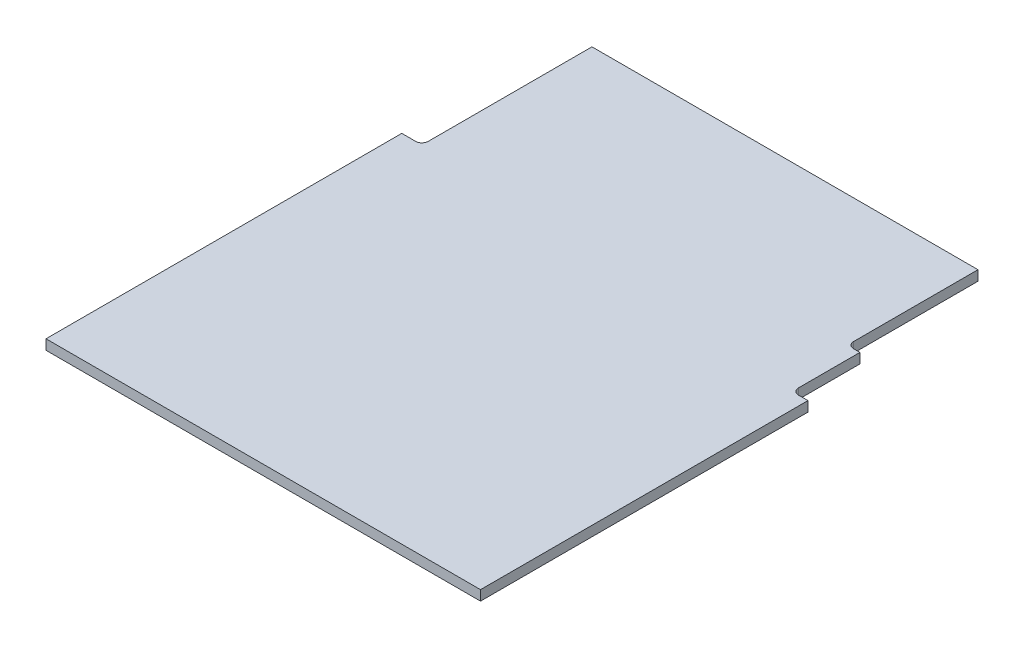
ISO-10303-21;
HEADER;
FILE_DESCRIPTION(('STEP AP214'),'2;1');
FILE_NAME('part.step','',(''),(''),'','','');
FILE_SCHEMA(('AUTOMOTIVE_DESIGN { 1 0 10303 214 1 1 1 1 }'));
ENDSEC;
DATA;
#1=APPLICATION_CONTEXT('core data for automotive mechanical design processes');
#2=APPLICATION_PROTOCOL_DEFINITION('international standard','automotive_design',2000,#1);
#3=PRODUCT_CONTEXT('',#1,'mechanical');
#4=PRODUCT('Part','Part','',(#3));
#5=PRODUCT_RELATED_PRODUCT_CATEGORY('part','',(#4));
#6=PRODUCT_DEFINITION_FORMATION('','',#4);
#7=PRODUCT_DEFINITION_CONTEXT('part definition',#1,'design');
#8=PRODUCT_DEFINITION('design','',#6,#7);
#9=PRODUCT_DEFINITION_SHAPE('','',#8);
#10=(LENGTH_UNIT() NAMED_UNIT(*) SI_UNIT(.MILLI.,.METRE.));
#11=(NAMED_UNIT(*) PLANE_ANGLE_UNIT() SI_UNIT($,.RADIAN.));
#12=(NAMED_UNIT(*) SI_UNIT($,.STERADIAN.) SOLID_ANGLE_UNIT());
#13=UNCERTAINTY_MEASURE_WITH_UNIT(LENGTH_MEASURE(1.E-05),#10,'distance_accuracy_value','');
#14=(GEOMETRIC_REPRESENTATION_CONTEXT(3) GLOBAL_UNCERTAINTY_ASSIGNED_CONTEXT((#13)) GLOBAL_UNIT_ASSIGNED_CONTEXT((#10,
#11,#12)) REPRESENTATION_CONTEXT('',''));
#15=CARTESIAN_POINT('',(0.,0.,0.));
#16=DIRECTION('',(0.,0.,1.));
#17=DIRECTION('',(1.,0.,0.));
#18=AXIS2_PLACEMENT_3D('',#15,#16,#17);
#19=CARTESIAN_POINT('',(-34.5,1.5875,16.));
#20=DIRECTION('',(0.,0.,-1.));
#21=DIRECTION('',(-1.,0.,0.));
#22=AXIS2_PLACEMENT_3D('',#19,#20,#21);
#23=PLANE('',#22);
#24=DIRECTION('',(1.,0.,0.));
#25=VECTOR('',#24,1.);
#26=CARTESIAN_POINT('',(-34.5,0.,16.));
#27=LINE('',#26,#25);
#28=CARTESIAN_POINT('',(-34.5,0.,16.));
#29=VERTEX_POINT('',#28);
#30=CARTESIAN_POINT('',(34.5,0.,16.));
#31=VERTEX_POINT('',#30);
#32=EDGE_CURVE('E163',#29,#31,#27,.T.);
#33=ORIENTED_EDGE('',*,*,#32,.T.);
#34=DIRECTION('',(0.,-1.,0.));
#35=VECTOR('',#34,1.);
#36=CARTESIAN_POINT('',(34.5,1.5875,16.));
#37=LINE('',#36,#35);
#38=CARTESIAN_POINT('',(34.5,1.5875,16.));
#39=VERTEX_POINT('',#38);
#40=EDGE_CURVE('E41',#39,#31,#37,.T.);
#41=ORIENTED_EDGE('',*,*,#40,.F.);
#42=DIRECTION('',(1.,0.,0.));
#43=VECTOR('',#42,1.);
#44=CARTESIAN_POINT('',(-34.5,1.5875,16.));
#45=LINE('',#44,#43);
#46=CARTESIAN_POINT('',(-34.5,1.5875,16.));
#47=VERTEX_POINT('',#46);
#48=EDGE_CURVE('E108',#47,#39,#45,.T.);
#49=ORIENTED_EDGE('',*,*,#48,.F.);
#50=DIRECTION('',(0.,-1.,0.));
#51=VECTOR('',#50,1.);
#52=CARTESIAN_POINT('',(-34.5,1.5875,16.));
#53=LINE('',#52,#51);
#54=EDGE_CURVE('E11',#47,#29,#53,.T.);
#55=ORIENTED_EDGE('',*,*,#54,.T.);
#56=EDGE_LOOP('',(#33,#41,#49,#55));
#57=FACE_BOUND('',#56,.T.);
#58=ADVANCED_FACE('F33',(#57),#23,.F.);
#59=CARTESIAN_POINT('',(34.5,1.5875,9.));
#60=DIRECTION('',(-1.,0.,0.));
#61=DIRECTION('',(0.,0.,1.));
#62=AXIS2_PLACEMENT_3D('',#59,#60,#61);
#63=PLANE('',#62);
#64=DIRECTION('',(0.,0.,-1.));
#65=VECTOR('',#64,1.);
#66=CARTESIAN_POINT('',(34.5,0.,9.));
#67=LINE('',#66,#65);
#68=CARTESIAN_POINT('',(34.5,0.,-36.));
#69=VERTEX_POINT('',#68);
#70=EDGE_CURVE('E166',#31,#69,#67,.T.);
#71=ORIENTED_EDGE('',*,*,#70,.T.);
#72=DIRECTION('',(0.,-1.,0.));
#73=VECTOR('',#72,1.);
#74=CARTESIAN_POINT('',(34.5,1.5875,-36.));
#75=LINE('',#74,#73);
#76=CARTESIAN_POINT('',(34.5,1.5875,-36.));
#77=VERTEX_POINT('',#76);
#78=EDGE_CURVE('E208',#77,#69,#75,.T.);
#79=ORIENTED_EDGE('',*,*,#78,.F.);
#80=DIRECTION('',(0.,0.,-1.));
#81=VECTOR('',#80,1.);
#82=CARTESIAN_POINT('',(34.5,1.5875,16.));
#83=LINE('',#82,#81);
#84=EDGE_CURVE('E215',#39,#77,#83,.T.);
#85=ORIENTED_EDGE('',*,*,#84,.F.);
#86=ORIENTED_EDGE('',*,*,#40,.T.);
#87=EDGE_LOOP('',(#71,#79,#85,#86));
#88=FACE_BOUND('',#87,.T.);
#89=ADVANCED_FACE('F213',(#88),#63,.F.);
#90=CARTESIAN_POINT('',(32.9400076515611,1.5875,-36.));
#91=DIRECTION('',(0.,0.,1.));
#92=DIRECTION('',(1.,0.,0.));
#93=AXIS2_PLACEMENT_3D('',#90,#91,#92);
#94=PLANE('',#93);
#95=DIRECTION('',(-1.,0.,0.));
#96=VECTOR('',#95,1.);
#97=CARTESIAN_POINT('',(32.9400076515611,0.,-36.));
#98=LINE('',#97,#96);
#99=CARTESIAN_POINT('',(32.9400076515611,0.,-36.));
#100=VERTEX_POINT('',#99);
#101=EDGE_CURVE('E168',#69,#100,#98,.T.);
#102=ORIENTED_EDGE('',*,*,#101,.T.);
#103=DIRECTION('',(0.,-1.,0.));
#104=VECTOR('',#103,1.);
#105=CARTESIAN_POINT('',(32.9400076515611,1.5875,-36.));
#106=LINE('',#105,#104);
#107=CARTESIAN_POINT('',(32.9400076515611,1.5875,-36.));
#108=VERTEX_POINT('',#107);
#109=EDGE_CURVE('E205',#108,#100,#106,.T.);
#110=ORIENTED_EDGE('',*,*,#109,.F.);
#111=DIRECTION('',(-1.,0.,0.));
#112=VECTOR('',#111,1.);
#113=CARTESIAN_POINT('',(32.9400076515611,1.5875,-36.));
#114=LINE('',#113,#112);
#115=EDGE_CURVE('E234',#77,#108,#114,.T.);
#116=ORIENTED_EDGE('',*,*,#115,.F.);
#117=ORIENTED_EDGE('',*,*,#78,.T.);
#118=EDGE_LOOP('',(#102,#110,#116,#117));
#119=FACE_BOUND('',#118,.T.);
#120=ADVANCED_FACE('F225',(#119),#94,.F.);
#121=CARTESIAN_POINT('',(33.0019143896676,1.5875,-37.));
#122=DIRECTION('',(0.,-1.,0.));
#123=DIRECTION('',(0.,0.,-1.));
#124=AXIS2_PLACEMENT_3D('',#121,#122,#123);
#125=CYLINDRICAL_SURFACE('',#124,1.0019143896676);
#126=CARTESIAN_POINT('',(33.0019143896676,0.,-37.));
#127=DIRECTION('',(0.,-1.,0.));
#128=DIRECTION('',(0.,0.,1.));
#129=AXIS2_PLACEMENT_3D('',#126,#127,#128);
#130=CIRCLE('',#129,1.0019143896676);
#131=CARTESIAN_POINT('',(32.,0.,-37.));
#132=VERTEX_POINT('',#131);
#133=EDGE_CURVE('E170',#100,#132,#130,.T.);
#134=ORIENTED_EDGE('',*,*,#133,.T.);
#135=DIRECTION('',(0.,-1.,0.));
#136=VECTOR('',#135,1.);
#137=CARTESIAN_POINT('',(32.,1.5875,-37.));
#138=LINE('',#137,#136);
#139=CARTESIAN_POINT('',(32.,1.5875,-37.));
#140=VERTEX_POINT('',#139);
#141=EDGE_CURVE('E202',#140,#132,#138,.T.);
#142=ORIENTED_EDGE('',*,*,#141,.F.);
#143=CARTESIAN_POINT('',(33.0019143896676,1.5875,-37.));
#144=DIRECTION('',(0.,-1.,0.));
#145=DIRECTION('',(0.,0.,1.));
#146=AXIS2_PLACEMENT_3D('',#143,#144,#145);
#147=CIRCLE('',#146,1.0019143896676);
#148=EDGE_CURVE('E231',#108,#140,#147,.T.);
#149=ORIENTED_EDGE('',*,*,#148,.F.);
#150=ORIENTED_EDGE('',*,*,#109,.T.);
#151=EDGE_LOOP('',(#134,#142,#149,#150));
#152=FACE_BOUND('',#151,.T.);
#153=ADVANCED_FACE('F229',(#152),#125,.F.);
#154=CARTESIAN_POINT('',(32.,1.5875,-46.75));
#155=DIRECTION('',(-1.,0.,0.));
#156=DIRECTION('',(0.,0.,1.));
#157=AXIS2_PLACEMENT_3D('',#154,#155,#156);
#158=PLANE('',#157);
#159=DIRECTION('',(0.,0.,-1.));
#160=VECTOR('',#159,1.);
#161=CARTESIAN_POINT('',(32.,0.,-46.75));
#162=LINE('',#161,#160);
#163=CARTESIAN_POINT('',(32.,0.,-46.75));
#164=VERTEX_POINT('',#163);
#165=EDGE_CURVE('E172',#132,#164,#162,.T.);
#166=ORIENTED_EDGE('',*,*,#165,.T.);
#167=DIRECTION('',(0.,-1.,0.));
#168=VECTOR('',#167,1.);
#169=CARTESIAN_POINT('',(32.,1.5875,-46.75));
#170=LINE('',#169,#168);
#171=CARTESIAN_POINT('',(32.,1.5875,-46.75));
#172=VERTEX_POINT('',#171);
#173=EDGE_CURVE('E199',#172,#164,#170,.T.);
#174=ORIENTED_EDGE('',*,*,#173,.F.);
#175=DIRECTION('',(0.,0.,-1.));
#176=VECTOR('',#175,1.);
#177=CARTESIAN_POINT('',(32.,1.5875,-46.75));
#178=LINE('',#177,#176);
#179=EDGE_CURVE('E233',#140,#172,#178,.T.);
#180=ORIENTED_EDGE('',*,*,#179,.F.);
#181=ORIENTED_EDGE('',*,*,#141,.T.);
#182=EDGE_LOOP('',(#166,#174,#180,#181));
#183=FACE_BOUND('',#182,.T.);
#184=ADVANCED_FACE('F265',(#183),#158,.F.);
#185=CARTESIAN_POINT('',(31.,1.5875,-46.75));
#186=DIRECTION('',(0.,0.,1.));
#187=DIRECTION('',(1.,0.,0.));
#188=AXIS2_PLACEMENT_3D('',#185,#186,#187);
#189=PLANE('',#188);
#190=DIRECTION('',(-1.,0.,0.));
#191=VECTOR('',#190,1.);
#192=CARTESIAN_POINT('',(31.,0.,-46.75));
#193=LINE('',#192,#191);
#194=CARTESIAN_POINT('',(31.,0.,-46.75));
#195=VERTEX_POINT('',#194);
#196=EDGE_CURVE('E174',#164,#195,#193,.T.);
#197=ORIENTED_EDGE('',*,*,#196,.T.);
#198=DIRECTION('',(0.,-1.,0.));
#199=VECTOR('',#198,1.);
#200=CARTESIAN_POINT('',(31.,1.5875,-46.75));
#201=LINE('',#200,#199);
#202=CARTESIAN_POINT('',(31.,1.5875,-46.75));
#203=VERTEX_POINT('',#202);
#204=EDGE_CURVE('E196',#203,#195,#201,.T.);
#205=ORIENTED_EDGE('',*,*,#204,.F.);
#206=DIRECTION('',(-1.,0.,0.));
#207=VECTOR('',#206,1.);
#208=CARTESIAN_POINT('',(31.,1.5875,-46.75));
#209=LINE('',#208,#207);
#210=EDGE_CURVE('E236',#172,#203,#209,.T.);
#211=ORIENTED_EDGE('',*,*,#210,.F.);
#212=ORIENTED_EDGE('',*,*,#173,.T.);
#213=EDGE_LOOP('',(#197,#205,#211,#212));
#214=FACE_BOUND('',#213,.T.);
#215=ADVANCED_FACE('F262',(#214),#189,.F.);
#216=CARTESIAN_POINT('',(31.,1.5875,-47.75));
#217=DIRECTION('',(0.,-1.,0.));
#218=DIRECTION('',(0.,0.,-1.));
#219=AXIS2_PLACEMENT_3D('',#216,#217,#218);
#220=CYLINDRICAL_SURFACE('',#219,1.);
#221=CARTESIAN_POINT('',(31.,0.,-47.75));
#222=DIRECTION('',(0.,-1.,0.));
#223=DIRECTION('',(0.,0.,1.));
#224=AXIS2_PLACEMENT_3D('',#221,#222,#223);
#225=CIRCLE('',#224,1.);
#226=CARTESIAN_POINT('',(30.,0.,-47.75));
#227=VERTEX_POINT('',#226);
#228=EDGE_CURVE('E176',#195,#227,#225,.T.);
#229=ORIENTED_EDGE('',*,*,#228,.T.);
#230=DIRECTION('',(0.,-1.,0.));
#231=VECTOR('',#230,1.);
#232=CARTESIAN_POINT('',(30.,1.5875,-47.75));
#233=LINE('',#232,#231);
#234=CARTESIAN_POINT('',(30.,1.5875,-47.75));
#235=VERTEX_POINT('',#234);
#236=EDGE_CURVE('E193',#235,#227,#233,.T.);
#237=ORIENTED_EDGE('',*,*,#236,.F.);
#238=CARTESIAN_POINT('',(31.,1.5875,-47.75));
#239=DIRECTION('',(0.,-1.,0.));
#240=DIRECTION('',(0.,0.,1.));
#241=AXIS2_PLACEMENT_3D('',#238,#239,#240);
#242=CIRCLE('',#241,1.);
#243=EDGE_CURVE('E242',#203,#235,#242,.T.);
#244=ORIENTED_EDGE('',*,*,#243,.F.);
#245=ORIENTED_EDGE('',*,*,#204,.T.);
#246=EDGE_LOOP('',(#229,#237,#244,#245));
#247=FACE_BOUND('',#246,.T.);
#248=ADVANCED_FACE('F258',(#247),#220,.F.);
#249=CARTESIAN_POINT('',(30.,1.5875,-67.5));
#250=DIRECTION('',(-1.,0.,0.));
#251=DIRECTION('',(0.,0.,1.));
#252=AXIS2_PLACEMENT_3D('',#249,#250,#251);
#253=PLANE('',#252);
#254=DIRECTION('',(0.,0.,-1.));
#255=VECTOR('',#254,1.);
#256=CARTESIAN_POINT('',(30.,0.,-67.5));
#257=LINE('',#256,#255);
#258=CARTESIAN_POINT('',(30.,0.,-67.5));
#259=VERTEX_POINT('',#258);
#260=EDGE_CURVE('E178',#227,#259,#257,.T.);
#261=ORIENTED_EDGE('',*,*,#260,.T.);
#262=DIRECTION('',(0.,-1.,0.));
#263=VECTOR('',#262,1.);
#264=CARTESIAN_POINT('',(30.,1.5875,-67.5));
#265=LINE('',#264,#263);
#266=CARTESIAN_POINT('',(30.,1.5875,-67.5));
#267=VERTEX_POINT('',#266);
#268=EDGE_CURVE('E190',#267,#259,#265,.T.);
#269=ORIENTED_EDGE('',*,*,#268,.F.);
#270=DIRECTION('',(0.,0.,-1.));
#271=VECTOR('',#270,1.);
#272=CARTESIAN_POINT('',(30.,1.5875,-67.5));
#273=LINE('',#272,#271);
#274=EDGE_CURVE('E244',#235,#267,#273,.T.);
#275=ORIENTED_EDGE('',*,*,#274,.F.);
#276=ORIENTED_EDGE('',*,*,#236,.T.);
#277=EDGE_LOOP('',(#261,#269,#275,#276));
#278=FACE_BOUND('',#277,.T.);
#279=ADVANCED_FACE('F250',(#278),#253,.F.);
#280=CARTESIAN_POINT('',(30.,1.5875,-67.5));
#281=DIRECTION('',(0.,0.,1.));
#282=DIRECTION('',(1.,0.,0.));
#283=AXIS2_PLACEMENT_3D('',#280,#281,#282);
#284=PLANE('',#283);
#285=DIRECTION('',(-1.,0.,0.));
#286=VECTOR('',#285,1.);
#287=CARTESIAN_POINT('',(30.,0.,-67.5));
#288=LINE('',#287,#286);
#289=CARTESIAN_POINT('',(-31.3000000000001,0.,-67.5));
#290=VERTEX_POINT('',#289);
#291=EDGE_CURVE('E180',#259,#290,#288,.T.);
#292=ORIENTED_EDGE('',*,*,#291,.T.);
#293=DIRECTION('',(0.,-1.,0.));
#294=VECTOR('',#293,1.);
#295=CARTESIAN_POINT('',(-31.3000000000001,1.5875,-67.5));
#296=LINE('',#295,#294);
#297=CARTESIAN_POINT('',(-31.3000000000001,1.5875,-67.5));
#298=VERTEX_POINT('',#297);
#299=EDGE_CURVE('E152',#298,#290,#296,.T.);
#300=ORIENTED_EDGE('',*,*,#299,.F.);
#301=DIRECTION('',(-1.,0.,0.));
#302=VECTOR('',#301,1.);
#303=CARTESIAN_POINT('',(30.,1.5875,-67.5));
#304=LINE('',#303,#302);
#305=EDGE_CURVE('E143',#267,#298,#304,.T.);
#306=ORIENTED_EDGE('',*,*,#305,.F.);
#307=ORIENTED_EDGE('',*,*,#268,.T.);
#308=EDGE_LOOP('',(#292,#300,#306,#307));
#309=FACE_BOUND('',#308,.T.);
#310=ADVANCED_FACE('F254',(#309),#284,.F.);
#311=CARTESIAN_POINT('',(-31.3000000000001,1.5875,-67.5));
#312=DIRECTION('',(1.,0.,0.));
#313=DIRECTION('',(0.,0.,-1.));
#314=AXIS2_PLACEMENT_3D('',#311,#312,#313);
#315=PLANE('',#314);
#316=DIRECTION('',(0.,0.,1.));
#317=VECTOR('',#316,1.);
#318=CARTESIAN_POINT('',(-31.3000000000001,0.,-67.5));
#319=LINE('',#318,#317);
#320=CARTESIAN_POINT('',(-31.3000000000001,0.,-41.5));
#321=VERTEX_POINT('',#320);
#322=EDGE_CURVE('E151',#290,#321,#319,.T.);
#323=ORIENTED_EDGE('',*,*,#322,.T.);
#324=DIRECTION('',(0.,-1.,0.));
#325=VECTOR('',#324,1.);
#326=CARTESIAN_POINT('',(-31.3000000000001,1.5875,-41.5));
#327=LINE('',#326,#325);
#328=CARTESIAN_POINT('',(-31.3000000000001,1.5875,-41.5));
#329=VERTEX_POINT('',#328);
#330=EDGE_CURVE('E148',#329,#321,#327,.T.);
#331=ORIENTED_EDGE('',*,*,#330,.F.);
#332=DIRECTION('',(0.,0.,1.));
#333=VECTOR('',#332,1.);
#334=CARTESIAN_POINT('',(-31.3000000000001,1.5875,-67.5));
#335=LINE('',#334,#333);
#336=EDGE_CURVE('E137',#298,#329,#335,.T.);
#337=ORIENTED_EDGE('',*,*,#336,.F.);
#338=ORIENTED_EDGE('',*,*,#299,.T.);
#339=EDGE_LOOP('',(#323,#331,#337,#338));
#340=FACE_BOUND('',#339,.T.);
#341=ADVANCED_FACE('F149',(#340),#315,.F.);
#342=CARTESIAN_POINT('',(-32.3036132359723,1.5875,-41.5));
#343=DIRECTION('',(0.,-1.,0.));
#344=DIRECTION('',(0.,0.,-1.));
#345=AXIS2_PLACEMENT_3D('',#342,#343,#344);
#346=CYLINDRICAL_SURFACE('',#345,1.0036132359722);
#347=CARTESIAN_POINT('',(-32.3036132359723,0.,-41.5));
#348=DIRECTION('',(0.,-1.,0.));
#349=DIRECTION('',(0.,0.,-1.));
#350=AXIS2_PLACEMENT_3D('',#347,#348,#349);
#351=CIRCLE('',#350,1.0036132359722);
#352=CARTESIAN_POINT('',(-32.2185278234824,0.,-40.5));
#353=VERTEX_POINT('',#352);
#354=EDGE_CURVE('E94',#321,#353,#351,.T.);
#355=ORIENTED_EDGE('',*,*,#354,.T.);
#356=DIRECTION('',(0.,-1.,0.));
#357=VECTOR('',#356,1.);
#358=CARTESIAN_POINT('',(-32.2185278234824,1.5875,-40.5));
#359=LINE('',#358,#357);
#360=CARTESIAN_POINT('',(-32.2185278234824,1.5875,-40.5));
#361=VERTEX_POINT('',#360);
#362=EDGE_CURVE('E153',#361,#353,#359,.T.);
#363=ORIENTED_EDGE('',*,*,#362,.F.);
#364=CARTESIAN_POINT('',(-32.3036132359723,1.5875,-41.5));
#365=DIRECTION('',(0.,-1.,0.));
#366=DIRECTION('',(0.,0.,-1.));
#367=AXIS2_PLACEMENT_3D('',#364,#365,#366);
#368=CIRCLE('',#367,1.0036132359722);
#369=EDGE_CURVE('E141',#329,#361,#368,.T.);
#370=ORIENTED_EDGE('',*,*,#369,.F.);
#371=ORIENTED_EDGE('',*,*,#330,.T.);
#372=EDGE_LOOP('',(#355,#363,#370,#371));
#373=FACE_BOUND('',#372,.T.);
#374=ADVANCED_FACE('F155',(#373),#346,.F.);
#375=CARTESIAN_POINT('',(-32.2185278234824,1.5875,-40.5));
#376=DIRECTION('',(0.,0.,1.));
#377=DIRECTION('',(1.,0.,0.));
#378=AXIS2_PLACEMENT_3D('',#375,#376,#377);
#379=PLANE('',#378);
#380=DIRECTION('',(-1.,0.,0.));
#381=VECTOR('',#380,1.);
#382=CARTESIAN_POINT('',(-32.2185278234824,0.,-40.5));
#383=LINE('',#382,#381);
#384=CARTESIAN_POINT('',(-34.5,0.,-40.5));
#385=VERTEX_POINT('',#384);
#386=EDGE_CURVE('E101',#353,#385,#383,.T.);
#387=ORIENTED_EDGE('',*,*,#386,.T.);
#388=DIRECTION('',(0.,-1.,0.));
#389=VECTOR('',#388,1.);
#390=CARTESIAN_POINT('',(-34.5,1.5875,-40.5));
#391=LINE('',#390,#389);
#392=CARTESIAN_POINT('',(-34.5,1.5875,-40.5));
#393=VERTEX_POINT('',#392);
#394=EDGE_CURVE('E159',#393,#385,#391,.T.);
#395=ORIENTED_EDGE('',*,*,#394,.F.);
#396=DIRECTION('',(-1.,0.,0.));
#397=VECTOR('',#396,1.);
#398=CARTESIAN_POINT('',(-32.2185278234824,1.5875,-40.5));
#399=LINE('',#398,#397);
#400=EDGE_CURVE('E157',#361,#393,#399,.T.);
#401=ORIENTED_EDGE('',*,*,#400,.F.);
#402=ORIENTED_EDGE('',*,*,#362,.T.);
#403=EDGE_LOOP('',(#387,#395,#401,#402));
#404=FACE_BOUND('',#403,.T.);
#405=ADVANCED_FACE('F339',(#404),#379,.F.);
#406=CARTESIAN_POINT('',(-34.5,1.5875,-40.5));
#407=DIRECTION('',(1.,0.,0.));
#408=DIRECTION('',(0.,0.,-1.));
#409=AXIS2_PLACEMENT_3D('',#406,#407,#408);
#410=PLANE('',#409);
#411=DIRECTION('',(0.,0.,1.));
#412=VECTOR('',#411,1.);
#413=CARTESIAN_POINT('',(-34.5,0.,-40.5));
#414=LINE('',#413,#412);
#415=EDGE_CURVE('E185',#385,#29,#414,.T.);
#416=ORIENTED_EDGE('',*,*,#415,.T.);
#417=ORIENTED_EDGE('',*,*,#54,.F.);
#418=DIRECTION('',(0.,0.,1.));
#419=VECTOR('',#418,1.);
#420=CARTESIAN_POINT('',(-34.5,1.5875,9.));
#421=LINE('',#420,#419);
#422=EDGE_CURVE('E49',#393,#47,#421,.T.);
#423=ORIENTED_EDGE('',*,*,#422,.F.);
#424=ORIENTED_EDGE('',*,*,#394,.T.);
#425=EDGE_LOOP('',(#416,#417,#423,#424));
#426=FACE_BOUND('',#425,.T.);
#427=ADVANCED_FACE('F348',(#426),#410,.F.);
#428=CARTESIAN_POINT('',(33.0019143896676,1.5875,-37.));
#429=DIRECTION('',(0.,1.,0.));
#430=DIRECTION('',(0.,0.,1.));
#431=AXIS2_PLACEMENT_3D('',#428,#429,#430);
#432=PLANE('',#431);
#433=ORIENTED_EDGE('',*,*,#422,.T.);
#434=ORIENTED_EDGE('',*,*,#48,.T.);
#435=ORIENTED_EDGE('',*,*,#84,.T.);
#436=ORIENTED_EDGE('',*,*,#115,.T.);
#437=ORIENTED_EDGE('',*,*,#148,.T.);
#438=ORIENTED_EDGE('',*,*,#179,.T.);
#439=ORIENTED_EDGE('',*,*,#210,.T.);
#440=ORIENTED_EDGE('',*,*,#243,.T.);
#441=ORIENTED_EDGE('',*,*,#274,.T.);
#442=ORIENTED_EDGE('',*,*,#305,.T.);
#443=ORIENTED_EDGE('',*,*,#336,.T.);
#444=ORIENTED_EDGE('',*,*,#369,.T.);
#445=ORIENTED_EDGE('',*,*,#400,.T.);
#446=EDGE_LOOP('',(#433,#434,#435,#436,#437,#438,#439,#440,#441,#442,#443,#444,#445));
#447=FACE_BOUND('',#446,.T.);
#448=ADVANCED_FACE('F139',(#447),#432,.T.);
#449=CARTESIAN_POINT('',(33.0019143896676,0.,-37.));
#450=DIRECTION('',(0.,1.,0.));
#451=DIRECTION('',(0.,0.,1.));
#452=AXIS2_PLACEMENT_3D('',#449,#450,#451);
#453=PLANE('',#452);
#454=ORIENTED_EDGE('',*,*,#32,.F.);
#455=ORIENTED_EDGE('',*,*,#415,.F.);
#456=ORIENTED_EDGE('',*,*,#386,.F.);
#457=ORIENTED_EDGE('',*,*,#354,.F.);
#458=ORIENTED_EDGE('',*,*,#322,.F.);
#459=ORIENTED_EDGE('',*,*,#291,.F.);
#460=ORIENTED_EDGE('',*,*,#260,.F.);
#461=ORIENTED_EDGE('',*,*,#228,.F.);
#462=ORIENTED_EDGE('',*,*,#196,.F.);
#463=ORIENTED_EDGE('',*,*,#165,.F.);
#464=ORIENTED_EDGE('',*,*,#133,.F.);
#465=ORIENTED_EDGE('',*,*,#101,.F.);
#466=ORIENTED_EDGE('',*,*,#70,.F.);
#467=EDGE_LOOP('',(#454,#455,#456,#457,#458,#459,#460,#461,#462,#463,#464,#465,#466));
#468=FACE_BOUND('',#467,.T.);
#469=ADVANCED_FACE('F219',(#468),#453,.F.);
#470=CLOSED_SHELL('',(#58,#89,#120,#153,#184,#215,#248,#279,#310,#341,#374,#405,#427,#448,#469));
#471=MANIFOLD_SOLID_BREP('B2',#470);
#472=ADVANCED_BREP_SHAPE_REPRESENTATION('',(#18,#471),#14);
#473=SHAPE_DEFINITION_REPRESENTATION(#9,#472);
ENDSEC;
END-ISO-10303-21;
